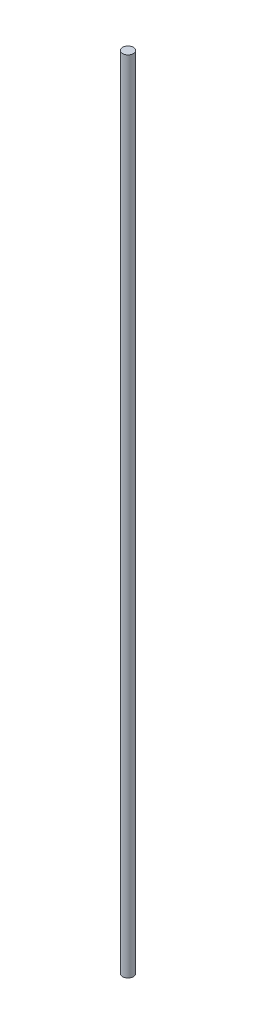
ISO-10303-21;
HEADER;
FILE_DESCRIPTION(('STEP AP214'),'2;1');
FILE_NAME('part.step','',(''),(''),'','','');
FILE_SCHEMA(('AUTOMOTIVE_DESIGN { 1 0 10303 214 1 1 1 1 }'));
ENDSEC;
DATA;
#1=APPLICATION_CONTEXT('core data for automotive mechanical design processes');
#2=APPLICATION_PROTOCOL_DEFINITION('international standard','automotive_design',2000,#1);
#3=PRODUCT_CONTEXT('',#1,'mechanical');
#4=PRODUCT('Part','Part','',(#3));
#5=PRODUCT_RELATED_PRODUCT_CATEGORY('part','',(#4));
#6=PRODUCT_DEFINITION_FORMATION('','',#4);
#7=PRODUCT_DEFINITION_CONTEXT('part definition',#1,'design');
#8=PRODUCT_DEFINITION('design','',#6,#7);
#9=PRODUCT_DEFINITION_SHAPE('','',#8);
#10=(LENGTH_UNIT() NAMED_UNIT(*) SI_UNIT(.MILLI.,.METRE.));
#11=(NAMED_UNIT(*) PLANE_ANGLE_UNIT() SI_UNIT($,.RADIAN.));
#12=(NAMED_UNIT(*) SI_UNIT($,.STERADIAN.) SOLID_ANGLE_UNIT());
#13=UNCERTAINTY_MEASURE_WITH_UNIT(LENGTH_MEASURE(1.E-05),#10,'distance_accuracy_value','');
#14=(GEOMETRIC_REPRESENTATION_CONTEXT(3) GLOBAL_UNCERTAINTY_ASSIGNED_CONTEXT((#13)) GLOBAL_UNIT_ASSIGNED_CONTEXT((#10,
#11,#12)) REPRESENTATION_CONTEXT('',''));
#15=CARTESIAN_POINT('',(0.,0.,0.));
#16=DIRECTION('',(0.,0.,1.));
#17=DIRECTION('',(1.,0.,0.));
#18=AXIS2_PLACEMENT_3D('',#15,#16,#17);
#19=CARTESIAN_POINT('',(0.,146.05,0.));
#20=DIRECTION('',(0.,-1.,0.));
#21=DIRECTION('',(0.,0.,-1.));
#22=AXIS2_PLACEMENT_3D('',#19,#20,#21);
#23=CYLINDRICAL_SURFACE('',#22,1.);
#24=CARTESIAN_POINT('',(0.,146.05,0.));
#25=DIRECTION('',(0.,1.,0.));
#26=DIRECTION('',(0.,0.,1.));
#27=AXIS2_PLACEMENT_3D('',#24,#25,#26);
#28=CIRCLE('',#27,1.);
#29=CARTESIAN_POINT('',(0.,146.05,1.));
#30=VERTEX_POINT('',#29);
#31=EDGE_CURVE('E10',#30,#30,#28,.T.);
#32=ORIENTED_EDGE('',*,*,#31,.F.);
#33=EDGE_LOOP('',(#32));
#34=FACE_BOUND('',#33,.T.);
#35=CARTESIAN_POINT('',(0.,0.,0.));
#36=DIRECTION('',(0.,1.,0.));
#37=DIRECTION('',(0.,0.,1.));
#38=AXIS2_PLACEMENT_3D('',#35,#36,#37);
#39=CIRCLE('',#38,1.);
#40=CARTESIAN_POINT('',(0.,0.,1.));
#41=VERTEX_POINT('',#40);
#42=EDGE_CURVE('E34',#41,#41,#39,.T.);
#43=ORIENTED_EDGE('',*,*,#42,.T.);
#44=EDGE_LOOP('',(#43));
#45=FACE_BOUND('',#44,.T.);
#46=ADVANCED_FACE('F31',(#34,#45),#23,.T.);
#47=CARTESIAN_POINT('',(0.,146.05,0.));
#48=DIRECTION('',(0.,1.,0.));
#49=DIRECTION('',(0.,0.,1.));
#50=AXIS2_PLACEMENT_3D('',#47,#48,#49);
#51=PLANE('',#50);
#52=ORIENTED_EDGE('',*,*,#31,.T.);
#53=EDGE_LOOP('',(#52));
#54=FACE_BOUND('',#53,.T.);
#55=ADVANCED_FACE('F46',(#54),#51,.T.);
#56=CARTESIAN_POINT('',(0.,0.,0.));
#57=DIRECTION('',(0.,1.,0.));
#58=DIRECTION('',(0.,0.,1.));
#59=AXIS2_PLACEMENT_3D('',#56,#57,#58);
#60=PLANE('',#59);
#61=ORIENTED_EDGE('',*,*,#42,.F.);
#62=EDGE_LOOP('',(#61));
#63=FACE_BOUND('',#62,.T.);
#64=ADVANCED_FACE('F44',(#63),#60,.F.);
#65=CLOSED_SHELL('',(#46,#55,#64));
#66=MANIFOLD_SOLID_BREP('B2',#65);
#67=ADVANCED_BREP_SHAPE_REPRESENTATION('',(#18,#66),#14);
#68=SHAPE_DEFINITION_REPRESENTATION(#9,#67);
ENDSEC;
END-ISO-10303-21;
